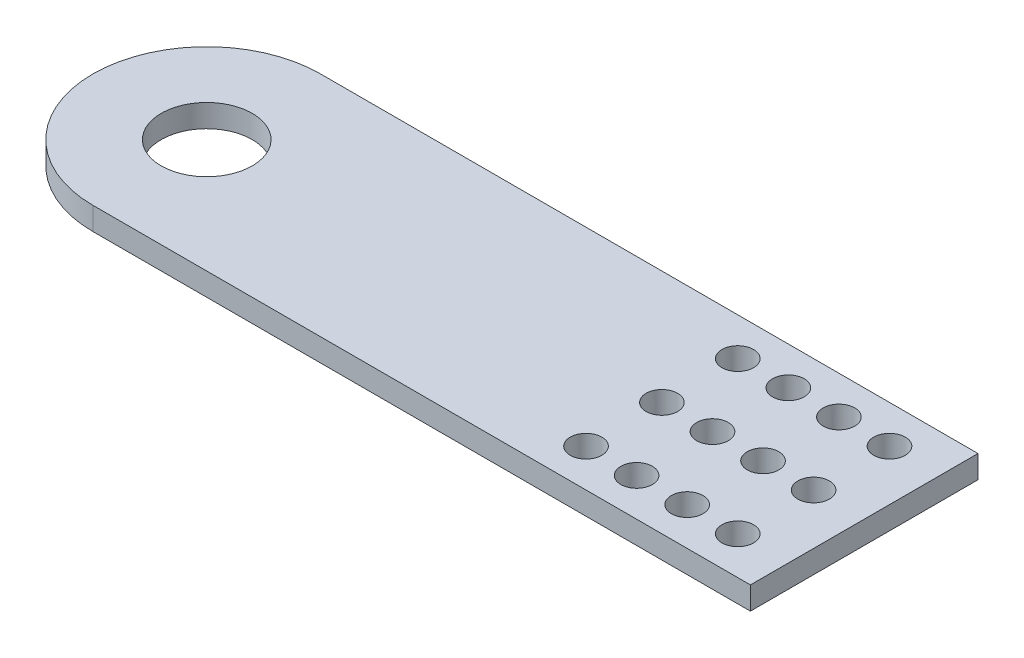
ISO-10303-21;
HEADER;
FILE_DESCRIPTION(('STEP AP214'),'2;1');
FILE_NAME('part.step','',(''),(''),'','','');
FILE_SCHEMA(('AUTOMOTIVE_DESIGN { 1 0 10303 214 1 1 1 1 }'));
ENDSEC;
DATA;
#1=APPLICATION_CONTEXT('core data for automotive mechanical design processes');
#2=APPLICATION_PROTOCOL_DEFINITION('international standard','automotive_design',2000,#1);
#3=PRODUCT_CONTEXT('',#1,'mechanical');
#4=PRODUCT('Part','Part','',(#3));
#5=PRODUCT_RELATED_PRODUCT_CATEGORY('part','',(#4));
#6=PRODUCT_DEFINITION_FORMATION('','',#4);
#7=PRODUCT_DEFINITION_CONTEXT('part definition',#1,'design');
#8=PRODUCT_DEFINITION('design','',#6,#7);
#9=PRODUCT_DEFINITION_SHAPE('','',#8);
#10=(LENGTH_UNIT() NAMED_UNIT(*) SI_UNIT(.MILLI.,.METRE.));
#11=(NAMED_UNIT(*) PLANE_ANGLE_UNIT() SI_UNIT($,.RADIAN.));
#12=(NAMED_UNIT(*) SI_UNIT($,.STERADIAN.) SOLID_ANGLE_UNIT());
#13=UNCERTAINTY_MEASURE_WITH_UNIT(LENGTH_MEASURE(1.E-05),#10,'distance_accuracy_value','');
#14=(GEOMETRIC_REPRESENTATION_CONTEXT(3) GLOBAL_UNCERTAINTY_ASSIGNED_CONTEXT((#13)) GLOBAL_UNIT_ASSIGNED_CONTEXT((#10,
#11,#12)) REPRESENTATION_CONTEXT('',''));
#15=CARTESIAN_POINT('',(0.,0.,0.));
#16=DIRECTION('',(0.,0.,1.));
#17=DIRECTION('',(1.,0.,0.));
#18=AXIS2_PLACEMENT_3D('',#15,#16,#17);
#19=CARTESIAN_POINT('',(0.,2.25,0.));
#20=DIRECTION('',(0.,-1.,0.));
#21=DIRECTION('',(0.,0.,-1.));
#22=AXIS2_PLACEMENT_3D('',#19,#20,#21);
#23=PLANE('',#22);
#24=CARTESIAN_POINT('',(90.,2.25,0.));
#25=DIRECTION('',(0.,-1.,0.));
#26=DIRECTION('',(0.,0.,-1.));
#27=AXIS2_PLACEMENT_3D('',#24,#25,#26);
#28=CIRCLE('',#27,3.125);
#29=CARTESIAN_POINT('',(90.,2.25,-3.125));
#30=VERTEX_POINT('',#29);
#31=EDGE_CURVE('E11',#30,#30,#28,.T.);
#32=ORIENTED_EDGE('',*,*,#31,.T.);
#33=EDGE_LOOP('',(#32));
#34=FACE_BOUND('',#33,.T.);
#35=CARTESIAN_POINT('',(100.,2.25,0.));
#36=DIRECTION('',(0.,-1.,0.));
#37=DIRECTION('',(0.,0.,-1.));
#38=AXIS2_PLACEMENT_3D('',#35,#36,#37);
#39=CIRCLE('',#38,3.125);
#40=CARTESIAN_POINT('',(100.,2.25,-3.125));
#41=VERTEX_POINT('',#40);
#42=EDGE_CURVE('E112',#41,#41,#39,.T.);
#43=ORIENTED_EDGE('',*,*,#42,.T.);
#44=EDGE_LOOP('',(#43));
#45=FACE_BOUND('',#44,.T.);
#46=CARTESIAN_POINT('',(0.,2.25,0.));
#47=DIRECTION('',(0.,1.,0.));
#48=DIRECTION('',(0.,0.,1.));
#49=AXIS2_PLACEMENT_3D('',#46,#47,#48);
#50=CIRCLE('',#49,9.);
#51=CARTESIAN_POINT('',(0.,2.25,9.));
#52=VERTEX_POINT('',#51);
#53=EDGE_CURVE('E103',#52,#52,#50,.T.);
#54=ORIENTED_EDGE('',*,*,#53,.F.);
#55=EDGE_LOOP('',(#54));
#56=FACE_BOUND('',#55,.T.);
#57=CARTESIAN_POINT('',(120.,2.25,0.));
#58=DIRECTION('',(0.,-1.,0.));
#59=DIRECTION('',(0.,0.,-1.));
#60=AXIS2_PLACEMENT_3D('',#57,#58,#59);
#61=CIRCLE('',#60,3.125);
#62=CARTESIAN_POINT('',(120.,2.25,-3.125));
#63=VERTEX_POINT('',#62);
#64=EDGE_CURVE('E137',#63,#63,#61,.T.);
#65=ORIENTED_EDGE('',*,*,#64,.T.);
#66=EDGE_LOOP('',(#65));
#67=FACE_BOUND('',#66,.T.);
#68=CARTESIAN_POINT('',(110.,2.25,0.));
#69=DIRECTION('',(0.,-1.,0.));
#70=DIRECTION('',(0.,0.,-1.));
#71=AXIS2_PLACEMENT_3D('',#68,#69,#70);
#72=CIRCLE('',#71,3.125);
#73=CARTESIAN_POINT('',(110.,2.25,-3.125));
#74=VERTEX_POINT('',#73);
#75=EDGE_CURVE('E141',#74,#74,#72,.T.);
#76=ORIENTED_EDGE('',*,*,#75,.T.);
#77=EDGE_LOOP('',(#76));
#78=FACE_BOUND('',#77,.T.);
#79=CARTESIAN_POINT('',(110.,2.25,-15.));
#80=DIRECTION('',(0.,-1.,0.));
#81=DIRECTION('',(0.,0.,-1.));
#82=AXIS2_PLACEMENT_3D('',#79,#80,#81);
#83=CIRCLE('',#82,3.125);
#84=CARTESIAN_POINT('',(110.,2.25,-18.125));
#85=VERTEX_POINT('',#84);
#86=EDGE_CURVE('E145',#85,#85,#83,.T.);
#87=ORIENTED_EDGE('',*,*,#86,.T.);
#88=EDGE_LOOP('',(#87));
#89=FACE_BOUND('',#88,.T.);
#90=CARTESIAN_POINT('',(110.,2.25,15.));
#91=DIRECTION('',(0.,-1.,0.));
#92=DIRECTION('',(0.,0.,-1.));
#93=AXIS2_PLACEMENT_3D('',#90,#91,#92);
#94=CIRCLE('',#93,3.125);
#95=CARTESIAN_POINT('',(110.,2.25,11.875));
#96=VERTEX_POINT('',#95);
#97=EDGE_CURVE('E149',#96,#96,#94,.T.);
#98=ORIENTED_EDGE('',*,*,#97,.T.);
#99=EDGE_LOOP('',(#98));
#100=FACE_BOUND('',#99,.T.);
#101=CARTESIAN_POINT('',(120.,2.25,-15.));
#102=DIRECTION('',(0.,-1.,0.));
#103=DIRECTION('',(0.,0.,-1.));
#104=AXIS2_PLACEMENT_3D('',#101,#102,#103);
#105=CIRCLE('',#104,3.125);
#106=CARTESIAN_POINT('',(120.,2.25,-18.125));
#107=VERTEX_POINT('',#106);
#108=EDGE_CURVE('E153',#107,#107,#105,.T.);
#109=ORIENTED_EDGE('',*,*,#108,.T.);
#110=EDGE_LOOP('',(#109));
#111=FACE_BOUND('',#110,.T.);
#112=CARTESIAN_POINT('',(120.,2.25,15.));
#113=DIRECTION('',(0.,-1.,0.));
#114=DIRECTION('',(0.,0.,-1.));
#115=AXIS2_PLACEMENT_3D('',#112,#113,#114);
#116=CIRCLE('',#115,3.125);
#117=CARTESIAN_POINT('',(120.,2.25,11.875));
#118=VERTEX_POINT('',#117);
#119=EDGE_CURVE('E157',#118,#118,#116,.T.);
#120=ORIENTED_EDGE('',*,*,#119,.T.);
#121=EDGE_LOOP('',(#120));
#122=FACE_BOUND('',#121,.T.);
#123=CARTESIAN_POINT('',(90.,2.25,-15.));
#124=DIRECTION('',(0.,-1.,0.));
#125=DIRECTION('',(0.,0.,-1.));
#126=AXIS2_PLACEMENT_3D('',#123,#124,#125);
#127=CIRCLE('',#126,3.125);
#128=CARTESIAN_POINT('',(90.,2.25,-18.125));
#129=VERTEX_POINT('',#128);
#130=EDGE_CURVE('E161',#129,#129,#127,.T.);
#131=ORIENTED_EDGE('',*,*,#130,.T.);
#132=EDGE_LOOP('',(#131));
#133=FACE_BOUND('',#132,.T.);
#134=CARTESIAN_POINT('',(90.,2.25,15.));
#135=DIRECTION('',(0.,-1.,0.));
#136=DIRECTION('',(0.,0.,-1.));
#137=AXIS2_PLACEMENT_3D('',#134,#135,#136);
#138=CIRCLE('',#137,3.125);
#139=CARTESIAN_POINT('',(90.,2.25,11.875));
#140=VERTEX_POINT('',#139);
#141=EDGE_CURVE('E165',#140,#140,#138,.T.);
#142=ORIENTED_EDGE('',*,*,#141,.T.);
#143=EDGE_LOOP('',(#142));
#144=FACE_BOUND('',#143,.T.);
#145=CARTESIAN_POINT('',(100.,2.25,-15.));
#146=DIRECTION('',(0.,-1.,0.));
#147=DIRECTION('',(0.,0.,-1.));
#148=AXIS2_PLACEMENT_3D('',#145,#146,#147);
#149=CIRCLE('',#148,3.125);
#150=CARTESIAN_POINT('',(100.,2.25,-18.125));
#151=VERTEX_POINT('',#150);
#152=EDGE_CURVE('E169',#151,#151,#149,.T.);
#153=ORIENTED_EDGE('',*,*,#152,.T.);
#154=EDGE_LOOP('',(#153));
#155=FACE_BOUND('',#154,.T.);
#156=CARTESIAN_POINT('',(100.,2.25,15.));
#157=DIRECTION('',(0.,-1.,0.));
#158=DIRECTION('',(0.,0.,-1.));
#159=AXIS2_PLACEMENT_3D('',#156,#157,#158);
#160=CIRCLE('',#159,3.125);
#161=CARTESIAN_POINT('',(100.,2.25,11.875));
#162=VERTEX_POINT('',#161);
#163=EDGE_CURVE('E172',#162,#162,#160,.T.);
#164=ORIENTED_EDGE('',*,*,#163,.T.);
#165=EDGE_LOOP('',(#164));
#166=FACE_BOUND('',#165,.T.);
#167=CARTESIAN_POINT('',(0.,2.25,0.));
#168=DIRECTION('',(0.,1.,0.));
#169=DIRECTION('',(0.,0.,1.));
#170=AXIS2_PLACEMENT_3D('',#167,#168,#169);
#171=CIRCLE('',#170,22.5);
#172=CARTESIAN_POINT('',(0.,2.25,-22.5));
#173=VERTEX_POINT('',#172);
#174=CARTESIAN_POINT('',(0.,2.25,22.5));
#175=VERTEX_POINT('',#174);
#176=EDGE_CURVE('E37',#173,#175,#171,.T.);
#177=ORIENTED_EDGE('',*,*,#176,.T.);
#178=DIRECTION('',(1.,0.,0.));
#179=VECTOR('',#178,1.);
#180=CARTESIAN_POINT('',(0.,2.25,22.5));
#181=LINE('',#180,#179);
#182=CARTESIAN_POINT('',(130.,2.25,22.5));
#183=VERTEX_POINT('',#182);
#184=EDGE_CURVE('E79',#175,#183,#181,.T.);
#185=ORIENTED_EDGE('',*,*,#184,.T.);
#186=DIRECTION('',(0.,0.,-1.));
#187=VECTOR('',#186,1.);
#188=CARTESIAN_POINT('',(130.,2.25,22.5));
#189=LINE('',#188,#187);
#190=CARTESIAN_POINT('',(130.,2.25,-22.5));
#191=VERTEX_POINT('',#190);
#192=EDGE_CURVE('E88',#183,#191,#189,.T.);
#193=ORIENTED_EDGE('',*,*,#192,.T.);
#194=DIRECTION('',(-1.,0.,0.));
#195=VECTOR('',#194,1.);
#196=CARTESIAN_POINT('',(130.,2.25,-22.5));
#197=LINE('',#196,#195);
#198=EDGE_CURVE('E82',#191,#173,#197,.T.);
#199=ORIENTED_EDGE('',*,*,#198,.T.);
#200=EDGE_LOOP('',(#177,#185,#193,#199));
#201=FACE_BOUND('',#200,.T.);
#202=ADVANCED_FACE('F33',(#34,#45,#56,#67,#78,#89,#100,#111,#122,#133,#144,#155,#166,#201),#23,.F.);
#203=CARTESIAN_POINT('',(0.,-2.25,0.));
#204=DIRECTION('',(0.,-1.,0.));
#205=DIRECTION('',(0.,0.,-1.));
#206=AXIS2_PLACEMENT_3D('',#203,#204,#205);
#207=PLANE('',#206);
#208=CARTESIAN_POINT('',(100.,-2.25,15.));
#209=DIRECTION('',(0.,1.,0.));
#210=DIRECTION('',(0.,0.,1.));
#211=AXIS2_PLACEMENT_3D('',#208,#209,#210);
#212=CIRCLE('',#211,3.125);
#213=CARTESIAN_POINT('',(100.,-2.25,18.125));
#214=VERTEX_POINT('',#213);
#215=EDGE_CURVE('E175',#214,#214,#212,.T.);
#216=ORIENTED_EDGE('',*,*,#215,.T.);
#217=EDGE_LOOP('',(#216));
#218=FACE_BOUND('',#217,.T.);
#219=CARTESIAN_POINT('',(100.,-2.25,-15.));
#220=DIRECTION('',(0.,1.,0.));
#221=DIRECTION('',(0.,0.,1.));
#222=AXIS2_PLACEMENT_3D('',#219,#220,#221);
#223=CIRCLE('',#222,3.125);
#224=CARTESIAN_POINT('',(100.,-2.25,-11.875));
#225=VERTEX_POINT('',#224);
#226=EDGE_CURVE('E83',#225,#225,#223,.T.);
#227=ORIENTED_EDGE('',*,*,#226,.T.);
#228=EDGE_LOOP('',(#227));
#229=FACE_BOUND('',#228,.T.);
#230=CARTESIAN_POINT('',(90.,-2.25,15.));
#231=DIRECTION('',(0.,1.,0.));
#232=DIRECTION('',(0.,0.,1.));
#233=AXIS2_PLACEMENT_3D('',#230,#231,#232);
#234=CIRCLE('',#233,3.125);
#235=CARTESIAN_POINT('',(90.,-2.25,18.125));
#236=VERTEX_POINT('',#235);
#237=EDGE_CURVE('E185',#236,#236,#234,.T.);
#238=ORIENTED_EDGE('',*,*,#237,.T.);
#239=EDGE_LOOP('',(#238));
#240=FACE_BOUND('',#239,.T.);
#241=CARTESIAN_POINT('',(90.,-2.25,-15.));
#242=DIRECTION('',(0.,1.,0.));
#243=DIRECTION('',(0.,0.,1.));
#244=AXIS2_PLACEMENT_3D('',#241,#242,#243);
#245=CIRCLE('',#244,3.125);
#246=CARTESIAN_POINT('',(90.,-2.25,-11.875));
#247=VERTEX_POINT('',#246);
#248=EDGE_CURVE('E174',#247,#247,#245,.T.);
#249=ORIENTED_EDGE('',*,*,#248,.T.);
#250=EDGE_LOOP('',(#249));
#251=FACE_BOUND('',#250,.T.);
#252=CARTESIAN_POINT('',(120.,-2.25,15.));
#253=DIRECTION('',(0.,1.,0.));
#254=DIRECTION('',(0.,0.,1.));
#255=AXIS2_PLACEMENT_3D('',#252,#253,#254);
#256=CIRCLE('',#255,3.125);
#257=CARTESIAN_POINT('',(120.,-2.25,18.125));
#258=VERTEX_POINT('',#257);
#259=EDGE_CURVE('E191',#258,#258,#256,.T.);
#260=ORIENTED_EDGE('',*,*,#259,.T.);
#261=EDGE_LOOP('',(#260));
#262=FACE_BOUND('',#261,.T.);
#263=CARTESIAN_POINT('',(120.,-2.25,-15.));
#264=DIRECTION('',(0.,1.,0.));
#265=DIRECTION('',(0.,0.,1.));
#266=AXIS2_PLACEMENT_3D('',#263,#264,#265);
#267=CIRCLE('',#266,3.125);
#268=CARTESIAN_POINT('',(120.,-2.25,-11.875));
#269=VERTEX_POINT('',#268);
#270=EDGE_CURVE('E188',#269,#269,#267,.T.);
#271=ORIENTED_EDGE('',*,*,#270,.T.);
#272=EDGE_LOOP('',(#271));
#273=FACE_BOUND('',#272,.T.);
#274=CARTESIAN_POINT('',(110.,-2.25,15.));
#275=DIRECTION('',(0.,1.,0.));
#276=DIRECTION('',(0.,0.,1.));
#277=AXIS2_PLACEMENT_3D('',#274,#275,#276);
#278=CIRCLE('',#277,3.125);
#279=CARTESIAN_POINT('',(110.,-2.25,18.125));
#280=VERTEX_POINT('',#279);
#281=EDGE_CURVE('E199',#280,#280,#278,.T.);
#282=ORIENTED_EDGE('',*,*,#281,.T.);
#283=EDGE_LOOP('',(#282));
#284=FACE_BOUND('',#283,.T.);
#285=CARTESIAN_POINT('',(110.,-2.25,-15.));
#286=DIRECTION('',(0.,1.,0.));
#287=DIRECTION('',(0.,0.,1.));
#288=AXIS2_PLACEMENT_3D('',#285,#286,#287);
#289=CIRCLE('',#288,3.125);
#290=CARTESIAN_POINT('',(110.,-2.25,-11.875));
#291=VERTEX_POINT('',#290);
#292=EDGE_CURVE('E195',#291,#291,#289,.T.);
#293=ORIENTED_EDGE('',*,*,#292,.T.);
#294=EDGE_LOOP('',(#293));
#295=FACE_BOUND('',#294,.T.);
#296=CARTESIAN_POINT('',(110.,-2.25,0.));
#297=DIRECTION('',(0.,1.,0.));
#298=DIRECTION('',(0.,0.,1.));
#299=AXIS2_PLACEMENT_3D('',#296,#297,#298);
#300=CIRCLE('',#299,3.125);
#301=CARTESIAN_POINT('',(110.,-2.25,3.125));
#302=VERTEX_POINT('',#301);
#303=EDGE_CURVE('E203',#302,#302,#300,.T.);
#304=ORIENTED_EDGE('',*,*,#303,.T.);
#305=EDGE_LOOP('',(#304));
#306=FACE_BOUND('',#305,.T.);
#307=CARTESIAN_POINT('',(120.,-2.25,0.));
#308=DIRECTION('',(0.,1.,0.));
#309=DIRECTION('',(0.,0.,1.));
#310=AXIS2_PLACEMENT_3D('',#307,#308,#309);
#311=CIRCLE('',#310,3.125);
#312=CARTESIAN_POINT('',(120.,-2.25,3.125));
#313=VERTEX_POINT('',#312);
#314=EDGE_CURVE('E210',#313,#313,#311,.T.);
#315=ORIENTED_EDGE('',*,*,#314,.T.);
#316=EDGE_LOOP('',(#315));
#317=FACE_BOUND('',#316,.T.);
#318=CARTESIAN_POINT('',(0.,-2.25,0.));
#319=DIRECTION('',(0.,1.,0.));
#320=DIRECTION('',(0.,0.,1.));
#321=AXIS2_PLACEMENT_3D('',#318,#319,#320);
#322=CIRCLE('',#321,9.);
#323=CARTESIAN_POINT('',(0.,-2.25,9.));
#324=VERTEX_POINT('',#323);
#325=EDGE_CURVE('E96',#324,#324,#322,.T.);
#326=ORIENTED_EDGE('',*,*,#325,.T.);
#327=EDGE_LOOP('',(#326));
#328=FACE_BOUND('',#327,.T.);
#329=CARTESIAN_POINT('',(100.,-2.25,0.));
#330=DIRECTION('',(0.,1.,0.));
#331=DIRECTION('',(0.,0.,1.));
#332=AXIS2_PLACEMENT_3D('',#329,#330,#331);
#333=CIRCLE('',#332,3.125);
#334=CARTESIAN_POINT('',(100.,-2.25,3.125));
#335=VERTEX_POINT('',#334);
#336=EDGE_CURVE('E109',#335,#335,#333,.T.);
#337=ORIENTED_EDGE('',*,*,#336,.T.);
#338=EDGE_LOOP('',(#337));
#339=FACE_BOUND('',#338,.T.);
#340=CARTESIAN_POINT('',(90.,-2.25,0.));
#341=DIRECTION('',(0.,1.,0.));
#342=DIRECTION('',(0.,0.,1.));
#343=AXIS2_PLACEMENT_3D('',#340,#341,#342);
#344=CIRCLE('',#343,3.125);
#345=CARTESIAN_POINT('',(90.,-2.25,3.125));
#346=VERTEX_POINT('',#345);
#347=EDGE_CURVE('E43',#346,#346,#344,.T.);
#348=ORIENTED_EDGE('',*,*,#347,.T.);
#349=EDGE_LOOP('',(#348));
#350=FACE_BOUND('',#349,.T.);
#351=DIRECTION('',(1.,0.,0.));
#352=VECTOR('',#351,1.);
#353=CARTESIAN_POINT('',(130.,-2.25,22.5));
#354=LINE('',#353,#352);
#355=CARTESIAN_POINT('',(0.,-2.25,22.5));
#356=VERTEX_POINT('',#355);
#357=CARTESIAN_POINT('',(130.,-2.25,22.5));
#358=VERTEX_POINT('',#357);
#359=EDGE_CURVE('E101',#356,#358,#354,.T.);
#360=ORIENTED_EDGE('',*,*,#359,.F.);
#361=CARTESIAN_POINT('',(0.,-2.25,0.));
#362=DIRECTION('',(0.,1.,0.));
#363=DIRECTION('',(0.,0.,1.));
#364=AXIS2_PLACEMENT_3D('',#361,#362,#363);
#365=CIRCLE('',#364,22.5);
#366=CARTESIAN_POINT('',(0.,-2.25,-22.5));
#367=VERTEX_POINT('',#366);
#368=EDGE_CURVE('E72',#367,#356,#365,.T.);
#369=ORIENTED_EDGE('',*,*,#368,.F.);
#370=DIRECTION('',(-1.,0.,0.));
#371=VECTOR('',#370,1.);
#372=CARTESIAN_POINT('',(0.,-2.25,-22.5));
#373=LINE('',#372,#371);
#374=CARTESIAN_POINT('',(130.,-2.25,-22.5));
#375=VERTEX_POINT('',#374);
#376=EDGE_CURVE('E89',#375,#367,#373,.T.);
#377=ORIENTED_EDGE('',*,*,#376,.F.);
#378=DIRECTION('',(0.,0.,-1.));
#379=VECTOR('',#378,1.);
#380=CARTESIAN_POINT('',(130.,-2.25,22.5));
#381=LINE('',#380,#379);
#382=EDGE_CURVE('E93',#358,#375,#381,.T.);
#383=ORIENTED_EDGE('',*,*,#382,.F.);
#384=EDGE_LOOP('',(#360,#369,#377,#383));
#385=FACE_BOUND('',#384,.T.);
#386=ADVANCED_FACE('F118',(#218,#229,#240,#251,#262,#273,#284,#295,#306,#317,#328,#339,#350,
#385),#207,.T.);
#387=CARTESIAN_POINT('',(130.,2.25,22.5));
#388=DIRECTION('',(0.,0.,-1.));
#389=DIRECTION('',(-1.,0.,0.));
#390=AXIS2_PLACEMENT_3D('',#387,#388,#389);
#391=PLANE('',#390);
#392=DIRECTION('',(0.,1.,0.));
#393=VECTOR('',#392,1.);
#394=CARTESIAN_POINT('',(0.,-2.25,22.5));
#395=LINE('',#394,#393);
#396=EDGE_CURVE('E70',#356,#175,#395,.T.);
#397=ORIENTED_EDGE('',*,*,#396,.F.);
#398=ORIENTED_EDGE('',*,*,#359,.T.);
#399=DIRECTION('',(0.,-1.,0.));
#400=VECTOR('',#399,1.);
#401=CARTESIAN_POINT('',(130.,2.25,22.5));
#402=LINE('',#401,#400);
#403=EDGE_CURVE('E86',#183,#358,#402,.T.);
#404=ORIENTED_EDGE('',*,*,#403,.F.);
#405=ORIENTED_EDGE('',*,*,#184,.F.);
#406=EDGE_LOOP('',(#397,#398,#404,#405));
#407=FACE_BOUND('',#406,.T.);
#408=ADVANCED_FACE('F84',(#407),#391,.F.);
#409=CARTESIAN_POINT('',(90.,-2.25,0.));
#410=DIRECTION('',(0.,1.,0.));
#411=DIRECTION('',(0.,0.,1.));
#412=AXIS2_PLACEMENT_3D('',#409,#410,#411);
#413=CYLINDRICAL_SURFACE('',#412,3.125);
#414=ORIENTED_EDGE('',*,*,#347,.F.);
#415=EDGE_LOOP('',(#414));
#416=FACE_BOUND('',#415,.T.);
#417=ORIENTED_EDGE('',*,*,#31,.F.);
#418=EDGE_LOOP('',(#417));
#419=FACE_BOUND('',#418,.T.);
#420=ADVANCED_FACE('F35',(#416,#419),#413,.F.);
#421=CARTESIAN_POINT('',(100.,-2.25,0.));
#422=DIRECTION('',(0.,1.,0.));
#423=DIRECTION('',(0.,0.,1.));
#424=AXIS2_PLACEMENT_3D('',#421,#422,#423);
#425=CYLINDRICAL_SURFACE('',#424,3.125);
#426=ORIENTED_EDGE('',*,*,#336,.F.);
#427=EDGE_LOOP('',(#426));
#428=FACE_BOUND('',#427,.T.);
#429=ORIENTED_EDGE('',*,*,#42,.F.);
#430=EDGE_LOOP('',(#429));
#431=FACE_BOUND('',#430,.T.);
#432=ADVANCED_FACE('F123',(#428,#431),#425,.F.);
#433=CARTESIAN_POINT('',(130.,2.25,22.5));
#434=DIRECTION('',(-1.,0.,0.));
#435=DIRECTION('',(0.,0.,1.));
#436=AXIS2_PLACEMENT_3D('',#433,#434,#435);
#437=PLANE('',#436);
#438=ORIENTED_EDGE('',*,*,#382,.T.);
#439=DIRECTION('',(0.,-1.,0.));
#440=VECTOR('',#439,1.);
#441=CARTESIAN_POINT('',(130.,2.25,-22.5));
#442=LINE('',#441,#440);
#443=EDGE_CURVE('E100',#191,#375,#442,.T.);
#444=ORIENTED_EDGE('',*,*,#443,.F.);
#445=ORIENTED_EDGE('',*,*,#192,.F.);
#446=ORIENTED_EDGE('',*,*,#403,.T.);
#447=EDGE_LOOP('',(#438,#444,#445,#446));
#448=FACE_BOUND('',#447,.T.);
#449=ADVANCED_FACE('F231',(#448),#437,.F.);
#450=CARTESIAN_POINT('',(0.,2.25,-22.5));
#451=DIRECTION('',(0.,0.,1.));
#452=DIRECTION('',(1.,0.,0.));
#453=AXIS2_PLACEMENT_3D('',#450,#451,#452);
#454=PLANE('',#453);
#455=ORIENTED_EDGE('',*,*,#376,.T.);
#456=DIRECTION('',(0.,1.,0.));
#457=VECTOR('',#456,1.);
#458=CARTESIAN_POINT('',(0.,-2.25,-22.5));
#459=LINE('',#458,#457);
#460=EDGE_CURVE('E67',#367,#173,#459,.T.);
#461=ORIENTED_EDGE('',*,*,#460,.T.);
#462=ORIENTED_EDGE('',*,*,#198,.F.);
#463=ORIENTED_EDGE('',*,*,#443,.T.);
#464=EDGE_LOOP('',(#455,#461,#462,#463));
#465=FACE_BOUND('',#464,.T.);
#466=ADVANCED_FACE('F222',(#465),#454,.F.);
#467=CARTESIAN_POINT('',(0.,2.25,0.));
#468=DIRECTION('',(0.,-1.,0.));
#469=DIRECTION('',(0.,0.,-1.));
#470=AXIS2_PLACEMENT_3D('',#467,#468,#469);
#471=CYLINDRICAL_SURFACE('',#470,9.);
#472=ORIENTED_EDGE('',*,*,#53,.T.);
#473=EDGE_LOOP('',(#472));
#474=FACE_BOUND('',#473,.T.);
#475=ORIENTED_EDGE('',*,*,#325,.F.);
#476=EDGE_LOOP('',(#475));
#477=FACE_BOUND('',#476,.T.);
#478=ADVANCED_FACE('F219',(#474,#477),#471,.F.);
#479=CARTESIAN_POINT('',(120.,-2.25,0.));
#480=DIRECTION('',(0.,1.,0.));
#481=DIRECTION('',(0.,0.,1.));
#482=AXIS2_PLACEMENT_3D('',#479,#480,#481);
#483=CYLINDRICAL_SURFACE('',#482,3.125);
#484=ORIENTED_EDGE('',*,*,#314,.F.);
#485=EDGE_LOOP('',(#484));
#486=FACE_BOUND('',#485,.T.);
#487=ORIENTED_EDGE('',*,*,#64,.F.);
#488=EDGE_LOOP('',(#487));
#489=FACE_BOUND('',#488,.T.);
#490=ADVANCED_FACE('F221',(#486,#489),#483,.F.);
#491=CARTESIAN_POINT('',(110.,-2.25,0.));
#492=DIRECTION('',(0.,1.,0.));
#493=DIRECTION('',(0.,0.,1.));
#494=AXIS2_PLACEMENT_3D('',#491,#492,#493);
#495=CYLINDRICAL_SURFACE('',#494,3.125);
#496=ORIENTED_EDGE('',*,*,#303,.F.);
#497=EDGE_LOOP('',(#496));
#498=FACE_BOUND('',#497,.T.);
#499=ORIENTED_EDGE('',*,*,#75,.F.);
#500=EDGE_LOOP('',(#499));
#501=FACE_BOUND('',#500,.T.);
#502=ADVANCED_FACE('F228',(#498,#501),#495,.F.);
#503=CARTESIAN_POINT('',(110.,-2.25,-15.));
#504=DIRECTION('',(0.,1.,0.));
#505=DIRECTION('',(0.,0.,1.));
#506=AXIS2_PLACEMENT_3D('',#503,#504,#505);
#507=CYLINDRICAL_SURFACE('',#506,3.125);
#508=ORIENTED_EDGE('',*,*,#292,.F.);
#509=EDGE_LOOP('',(#508));
#510=FACE_BOUND('',#509,.T.);
#511=ORIENTED_EDGE('',*,*,#86,.F.);
#512=EDGE_LOOP('',(#511));
#513=FACE_BOUND('',#512,.T.);
#514=ADVANCED_FACE('F333',(#510,#513),#507,.F.);
#515=CARTESIAN_POINT('',(110.,-2.25,15.));
#516=DIRECTION('',(0.,1.,0.));
#517=DIRECTION('',(0.,0.,1.));
#518=AXIS2_PLACEMENT_3D('',#515,#516,#517);
#519=CYLINDRICAL_SURFACE('',#518,3.125);
#520=ORIENTED_EDGE('',*,*,#281,.F.);
#521=EDGE_LOOP('',(#520));
#522=FACE_BOUND('',#521,.T.);
#523=ORIENTED_EDGE('',*,*,#97,.F.);
#524=EDGE_LOOP('',(#523));
#525=FACE_BOUND('',#524,.T.);
#526=ADVANCED_FACE('F325',(#522,#525),#519,.F.);
#527=CARTESIAN_POINT('',(120.,-2.25,-15.));
#528=DIRECTION('',(0.,1.,0.));
#529=DIRECTION('',(0.,0.,1.));
#530=AXIS2_PLACEMENT_3D('',#527,#528,#529);
#531=CYLINDRICAL_SURFACE('',#530,3.125);
#532=ORIENTED_EDGE('',*,*,#270,.F.);
#533=EDGE_LOOP('',(#532));
#534=FACE_BOUND('',#533,.T.);
#535=ORIENTED_EDGE('',*,*,#108,.F.);
#536=EDGE_LOOP('',(#535));
#537=FACE_BOUND('',#536,.T.);
#538=ADVANCED_FACE('F317',(#534,#537),#531,.F.);
#539=CARTESIAN_POINT('',(120.,-2.25,15.));
#540=DIRECTION('',(0.,1.,0.));
#541=DIRECTION('',(0.,0.,1.));
#542=AXIS2_PLACEMENT_3D('',#539,#540,#541);
#543=CYLINDRICAL_SURFACE('',#542,3.125);
#544=ORIENTED_EDGE('',*,*,#259,.F.);
#545=EDGE_LOOP('',(#544));
#546=FACE_BOUND('',#545,.T.);
#547=ORIENTED_EDGE('',*,*,#119,.F.);
#548=EDGE_LOOP('',(#547));
#549=FACE_BOUND('',#548,.T.);
#550=ADVANCED_FACE('F309',(#546,#549),#543,.F.);
#551=CARTESIAN_POINT('',(90.,-2.25,-15.));
#552=DIRECTION('',(0.,1.,0.));
#553=DIRECTION('',(0.,0.,1.));
#554=AXIS2_PLACEMENT_3D('',#551,#552,#553);
#555=CYLINDRICAL_SURFACE('',#554,3.125);
#556=ORIENTED_EDGE('',*,*,#248,.F.);
#557=EDGE_LOOP('',(#556));
#558=FACE_BOUND('',#557,.T.);
#559=ORIENTED_EDGE('',*,*,#130,.F.);
#560=EDGE_LOOP('',(#559));
#561=FACE_BOUND('',#560,.T.);
#562=ADVANCED_FACE('F301',(#558,#561),#555,.F.);
#563=CARTESIAN_POINT('',(90.,-2.25,15.));
#564=DIRECTION('',(0.,1.,0.));
#565=DIRECTION('',(0.,0.,1.));
#566=AXIS2_PLACEMENT_3D('',#563,#564,#565);
#567=CYLINDRICAL_SURFACE('',#566,3.125);
#568=ORIENTED_EDGE('',*,*,#237,.F.);
#569=EDGE_LOOP('',(#568));
#570=FACE_BOUND('',#569,.T.);
#571=ORIENTED_EDGE('',*,*,#141,.F.);
#572=EDGE_LOOP('',(#571));
#573=FACE_BOUND('',#572,.T.);
#574=ADVANCED_FACE('F293',(#570,#573),#567,.F.);
#575=CARTESIAN_POINT('',(100.,-2.25,-15.));
#576=DIRECTION('',(0.,1.,0.));
#577=DIRECTION('',(0.,0.,1.));
#578=AXIS2_PLACEMENT_3D('',#575,#576,#577);
#579=CYLINDRICAL_SURFACE('',#578,3.125);
#580=ORIENTED_EDGE('',*,*,#226,.F.);
#581=EDGE_LOOP('',(#580));
#582=FACE_BOUND('',#581,.T.);
#583=ORIENTED_EDGE('',*,*,#152,.F.);
#584=EDGE_LOOP('',(#583));
#585=FACE_BOUND('',#584,.T.);
#586=ADVANCED_FACE('F284',(#582,#585),#579,.F.);
#587=CARTESIAN_POINT('',(100.,-2.25,15.));
#588=DIRECTION('',(0.,1.,0.));
#589=DIRECTION('',(0.,0.,1.));
#590=AXIS2_PLACEMENT_3D('',#587,#588,#589);
#591=CYLINDRICAL_SURFACE('',#590,3.125);
#592=ORIENTED_EDGE('',*,*,#215,.F.);
#593=EDGE_LOOP('',(#592));
#594=FACE_BOUND('',#593,.T.);
#595=ORIENTED_EDGE('',*,*,#163,.F.);
#596=EDGE_LOOP('',(#595));
#597=FACE_BOUND('',#596,.T.);
#598=ADVANCED_FACE('F274',(#594,#597),#591,.F.);
#599=CARTESIAN_POINT('',(0.,-2.25,0.));
#600=DIRECTION('',(0.,1.,0.));
#601=DIRECTION('',(0.,0.,1.));
#602=AXIS2_PLACEMENT_3D('',#599,#600,#601);
#603=CYLINDRICAL_SURFACE('',#602,22.5);
#604=ORIENTED_EDGE('',*,*,#176,.F.);
#605=ORIENTED_EDGE('',*,*,#460,.F.);
#606=ORIENTED_EDGE('',*,*,#368,.T.);
#607=ORIENTED_EDGE('',*,*,#396,.T.);
#608=EDGE_LOOP('',(#604,#605,#606,#607));
#609=FACE_BOUND('',#608,.T.);
#610=ADVANCED_FACE('F71',(#609),#603,.T.);
#611=CLOSED_SHELL('',(#202,#386,#408,#420,#432,#449,#466,#478,#490,#502,#514,#526,#538,#550,
#562,#574,#586,#598,#610));
#612=MANIFOLD_SOLID_BREP('B2',#611);
#613=ADVANCED_BREP_SHAPE_REPRESENTATION('',(#18,#612),#14);
#614=SHAPE_DEFINITION_REPRESENTATION(#9,#613);
ENDSEC;
END-ISO-10303-21;
